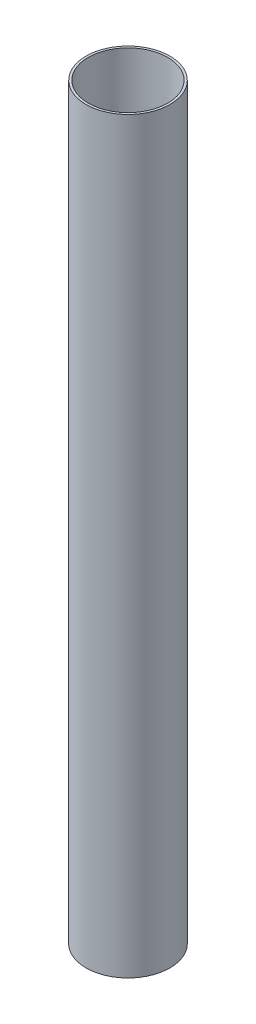
ISO-10303-21;
HEADER;
FILE_DESCRIPTION(('STEP AP214'),'2;1');
FILE_NAME('part.step','',(''),(''),'','','');
FILE_SCHEMA(('AUTOMOTIVE_DESIGN { 1 0 10303 214 1 1 1 1 }'));
ENDSEC;
DATA;
#1=APPLICATION_CONTEXT('core data for automotive mechanical design processes');
#2=APPLICATION_PROTOCOL_DEFINITION('international standard','automotive_design',2000,#1);
#3=PRODUCT_CONTEXT('',#1,'mechanical');
#4=PRODUCT('Part','Part','',(#3));
#5=PRODUCT_RELATED_PRODUCT_CATEGORY('part','',(#4));
#6=PRODUCT_DEFINITION_FORMATION('','',#4);
#7=PRODUCT_DEFINITION_CONTEXT('part definition',#1,'design');
#8=PRODUCT_DEFINITION('design','',#6,#7);
#9=PRODUCT_DEFINITION_SHAPE('','',#8);
#10=(LENGTH_UNIT() NAMED_UNIT(*) SI_UNIT(.MILLI.,.METRE.));
#11=(NAMED_UNIT(*) PLANE_ANGLE_UNIT() SI_UNIT($,.RADIAN.));
#12=(NAMED_UNIT(*) SI_UNIT($,.STERADIAN.) SOLID_ANGLE_UNIT());
#13=UNCERTAINTY_MEASURE_WITH_UNIT(LENGTH_MEASURE(1.E-05),#10,'distance_accuracy_value','');
#14=(GEOMETRIC_REPRESENTATION_CONTEXT(3) GLOBAL_UNCERTAINTY_ASSIGNED_CONTEXT((#13)) GLOBAL_UNIT_ASSIGNED_CONTEXT((#10,
#11,#12)) REPRESENTATION_CONTEXT('',''));
#15=CARTESIAN_POINT('',(0.,0.,0.));
#16=DIRECTION('',(0.,0.,1.));
#17=DIRECTION('',(1.,0.,0.));
#18=AXIS2_PLACEMENT_3D('',#15,#16,#17);
#19=CARTESIAN_POINT('',(0.,797.913336974403,0.));
#20=DIRECTION('',(0.,1.,0.));
#21=DIRECTION('',(0.,0.,1.));
#22=AXIS2_PLACEMENT_3D('',#19,#20,#21);
#23=CYLINDRICAL_SURFACE('',#22,26.9748);
#24=CARTESIAN_POINT('',(0.,0.,0.));
#25=DIRECTION('',(0.,1.,0.));
#26=DIRECTION('',(0.,0.,1.));
#27=AXIS2_PLACEMENT_3D('',#24,#25,#26);
#28=CIRCLE('',#27,26.9748);
#29=CARTESIAN_POINT('',(0.,0.,26.9748));
#30=VERTEX_POINT('',#29);
#31=EDGE_CURVE('E10',#30,#30,#28,.T.);
#32=ORIENTED_EDGE('',*,*,#31,.F.);
#33=EDGE_LOOP('',(#32));
#34=FACE_BOUND('',#33,.T.);
#35=CARTESIAN_POINT('',(0.,508.,0.));
#36=DIRECTION('',(0.,1.,0.));
#37=DIRECTION('',(0.,0.,1.));
#38=AXIS2_PLACEMENT_3D('',#35,#36,#37);
#39=CIRCLE('',#38,26.9747999999999);
#40=CARTESIAN_POINT('',(0.,508.,26.9747999999999));
#41=VERTEX_POINT('',#40);
#42=EDGE_CURVE('E50',#41,#41,#39,.T.);
#43=ORIENTED_EDGE('',*,*,#42,.T.);
#44=EDGE_LOOP('',(#43));
#45=FACE_BOUND('',#44,.T.);
#46=ADVANCED_FACE('F36',(#34,#45),#23,.F.);
#47=CARTESIAN_POINT('',(26.9748,0.,0.));
#48=DIRECTION('',(0.,1.,0.));
#49=DIRECTION('',(0.,0.,1.));
#50=AXIS2_PLACEMENT_3D('',#47,#48,#49);
#51=PLANE('',#50);
#52=CARTESIAN_POINT('',(0.,0.,0.));
#53=DIRECTION('',(0.,1.,0.));
#54=DIRECTION('',(0.,0.,1.));
#55=AXIS2_PLACEMENT_3D('',#52,#53,#54);
#56=CIRCLE('',#55,28.4988);
#57=CARTESIAN_POINT('',(0.,0.,28.4988));
#58=VERTEX_POINT('',#57);
#59=EDGE_CURVE('E42',#58,#58,#56,.T.);
#60=ORIENTED_EDGE('',*,*,#59,.F.);
#61=EDGE_LOOP('',(#60));
#62=FACE_BOUND('',#61,.T.);
#63=ORIENTED_EDGE('',*,*,#31,.T.);
#64=EDGE_LOOP('',(#63));
#65=FACE_BOUND('',#64,.T.);
#66=ADVANCED_FACE('F65',(#62,#65),#51,.F.);
#67=CARTESIAN_POINT('',(0.,797.913336974403,0.));
#68=DIRECTION('',(0.,1.,0.));
#69=DIRECTION('',(0.,0.,1.));
#70=AXIS2_PLACEMENT_3D('',#67,#68,#69);
#71=CYLINDRICAL_SURFACE('',#70,28.4988);
#72=CARTESIAN_POINT('',(0.,508.,0.));
#73=DIRECTION('',(0.,1.,0.));
#74=DIRECTION('',(0.,0.,1.));
#75=AXIS2_PLACEMENT_3D('',#72,#73,#74);
#76=CIRCLE('',#75,28.4987999999999);
#77=CARTESIAN_POINT('',(0.,508.,28.4987999999999));
#78=VERTEX_POINT('',#77);
#79=EDGE_CURVE('E46',#78,#78,#76,.T.);
#80=ORIENTED_EDGE('',*,*,#79,.F.);
#81=EDGE_LOOP('',(#80));
#82=FACE_BOUND('',#81,.T.);
#83=ORIENTED_EDGE('',*,*,#59,.T.);
#84=EDGE_LOOP('',(#83));
#85=FACE_BOUND('',#84,.T.);
#86=ADVANCED_FACE('F60',(#82,#85),#71,.T.);
#87=CARTESIAN_POINT('',(26.9747999999999,508.,0.));
#88=DIRECTION('',(0.,-1.,0.));
#89=DIRECTION('',(0.,0.,-1.));
#90=AXIS2_PLACEMENT_3D('',#87,#88,#89);
#91=PLANE('',#90);
#92=ORIENTED_EDGE('',*,*,#42,.F.);
#93=EDGE_LOOP('',(#92));
#94=FACE_BOUND('',#93,.T.);
#95=ORIENTED_EDGE('',*,*,#79,.T.);
#96=EDGE_LOOP('',(#95));
#97=FACE_BOUND('',#96,.T.);
#98=ADVANCED_FACE('F57',(#94,#97),#91,.F.);
#99=CLOSED_SHELL('',(#46,#66,#86,#98));
#100=MANIFOLD_SOLID_BREP('B2',#99);
#101=ADVANCED_BREP_SHAPE_REPRESENTATION('',(#18,#100),#14);
#102=SHAPE_DEFINITION_REPRESENTATION(#9,#101);
ENDSEC;
END-ISO-10303-21;
